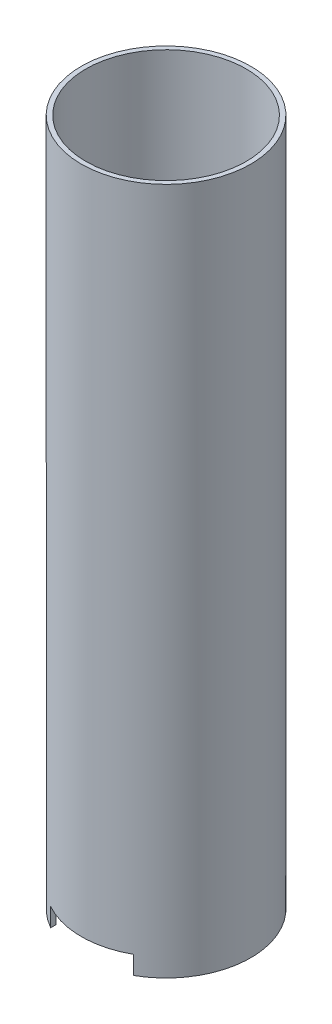
ISO-10303-21;
HEADER;
FILE_DESCRIPTION(('STEP AP214'),'2;1');
FILE_NAME('part.step','',(''),(''),'','','');
FILE_SCHEMA(('AUTOMOTIVE_DESIGN { 1 0 10303 214 1 1 1 1 }'));
ENDSEC;
DATA;
#1=APPLICATION_CONTEXT('core data for automotive mechanical design processes');
#2=APPLICATION_PROTOCOL_DEFINITION('international standard','automotive_design',2000,#1);
#3=PRODUCT_CONTEXT('',#1,'mechanical');
#4=PRODUCT('Part','Part','',(#3));
#5=PRODUCT_RELATED_PRODUCT_CATEGORY('part','',(#4));
#6=PRODUCT_DEFINITION_FORMATION('','',#4);
#7=PRODUCT_DEFINITION_CONTEXT('part definition',#1,'design');
#8=PRODUCT_DEFINITION('design','',#6,#7);
#9=PRODUCT_DEFINITION_SHAPE('','',#8);
#10=(LENGTH_UNIT() NAMED_UNIT(*) SI_UNIT(.MILLI.,.METRE.));
#11=(NAMED_UNIT(*) PLANE_ANGLE_UNIT() SI_UNIT($,.RADIAN.));
#12=(NAMED_UNIT(*) SI_UNIT($,.STERADIAN.) SOLID_ANGLE_UNIT());
#13=UNCERTAINTY_MEASURE_WITH_UNIT(LENGTH_MEASURE(1.E-05),#10,'distance_accuracy_value','');
#14=(GEOMETRIC_REPRESENTATION_CONTEXT(3) GLOBAL_UNCERTAINTY_ASSIGNED_CONTEXT((#13)) GLOBAL_UNIT_ASSIGNED_CONTEXT((#10,
#11,#12)) REPRESENTATION_CONTEXT('',''));
#15=CARTESIAN_POINT('',(0.,0.,0.));
#16=DIRECTION('',(0.,0.,1.));
#17=DIRECTION('',(1.,0.,0.));
#18=AXIS2_PLACEMENT_3D('',#15,#16,#17);
#19=CARTESIAN_POINT('',(0.,150.,0.));
#20=DIRECTION('',(0.,-1.,0.));
#21=DIRECTION('',(0.,0.,-1.));
#22=AXIS2_PLACEMENT_3D('',#19,#20,#21);
#23=CYLINDRICAL_SURFACE('',#22,17.5);
#24=CARTESIAN_POINT('',(0.,119.,0.));
#25=DIRECTION('',(0.,1.,0.));
#26=DIRECTION('',(0.,0.,1.));
#27=AXIS2_PLACEMENT_3D('',#24,#25,#26);
#28=CIRCLE('',#27,17.5);
#29=CARTESIAN_POINT('',(0.,119.,17.5));
#30=VERTEX_POINT('',#29);
#31=EDGE_CURVE('E206',#30,#30,#28,.T.);
#32=ORIENTED_EDGE('',*,*,#31,.T.);
#33=EDGE_LOOP('',(#32));
#34=FACE_BOUND('',#33,.T.);
#35=CARTESIAN_POINT('',(0.,4.,0.));
#36=DIRECTION('',(0.,1.,0.));
#37=DIRECTION('',(0.,0.,1.));
#38=AXIS2_PLACEMENT_3D('',#35,#36,#37);
#39=CIRCLE('',#38,17.5);
#40=CARTESIAN_POINT('',(9.01387818865997,4.,-15.));
#41=VERTEX_POINT('',#40);
#42=CARTESIAN_POINT('',(-9.01387818865997,4.,-15.));
#43=VERTEX_POINT('',#42);
#44=EDGE_CURVE('E132',#41,#43,#39,.T.);
#45=ORIENTED_EDGE('',*,*,#44,.F.);
#46=DIRECTION('',(0.,-1.,0.));
#47=VECTOR('',#46,1.);
#48=CARTESIAN_POINT('',(9.01387818865997,4.,-15.));
#49=LINE('',#48,#47);
#50=CARTESIAN_POINT('',(9.01387818865997,0.,-15.));
#51=VERTEX_POINT('',#50);
#52=EDGE_CURVE('E114',#41,#51,#49,.T.);
#53=ORIENTED_EDGE('',*,*,#52,.T.);
#54=CARTESIAN_POINT('',(0.,0.,0.));
#55=DIRECTION('',(0.,1.,0.));
#56=DIRECTION('',(0.,0.,1.));
#57=AXIS2_PLACEMENT_3D('',#54,#55,#56);
#58=CIRCLE('',#57,17.5);
#59=CARTESIAN_POINT('',(9.01387818865997,0.,15.));
#60=VERTEX_POINT('',#59);
#61=EDGE_CURVE('E218',#60,#51,#58,.T.);
#62=ORIENTED_EDGE('',*,*,#61,.F.);
#63=DIRECTION('',(0.,-1.,0.));
#64=VECTOR('',#63,1.);
#65=CARTESIAN_POINT('',(9.01387818865997,4.,15.));
#66=LINE('',#65,#64);
#67=CARTESIAN_POINT('',(9.01387818865997,4.,15.));
#68=VERTEX_POINT('',#67);
#69=EDGE_CURVE('E71',#68,#60,#66,.T.);
#70=ORIENTED_EDGE('',*,*,#69,.F.);
#71=CARTESIAN_POINT('',(0.,4.,0.));
#72=DIRECTION('',(0.,1.,0.));
#73=DIRECTION('',(0.,0.,1.));
#74=AXIS2_PLACEMENT_3D('',#71,#72,#73);
#75=CIRCLE('',#74,17.5);
#76=CARTESIAN_POINT('',(-9.01387818865997,4.,15.));
#77=VERTEX_POINT('',#76);
#78=EDGE_CURVE('E161',#77,#68,#75,.T.);
#79=ORIENTED_EDGE('',*,*,#78,.F.);
#80=DIRECTION('',(0.,-1.,0.));
#81=VECTOR('',#80,1.);
#82=CARTESIAN_POINT('',(-9.01387818865997,4.,15.));
#83=LINE('',#82,#81);
#84=CARTESIAN_POINT('',(-9.01387818865997,0.,15.));
#85=VERTEX_POINT('',#84);
#86=EDGE_CURVE('E151',#77,#85,#83,.T.);
#87=ORIENTED_EDGE('',*,*,#86,.T.);
#88=CARTESIAN_POINT('',(-9.01387818865997,0.,-15.));
#89=VERTEX_POINT('',#88);
#90=EDGE_CURVE('E225',#89,#85,#58,.T.);
#91=ORIENTED_EDGE('',*,*,#90,.F.);
#92=DIRECTION('',(0.,-1.,0.));
#93=VECTOR('',#92,1.);
#94=CARTESIAN_POINT('',(-9.01387818865997,4.,-15.));
#95=LINE('',#94,#93);
#96=EDGE_CURVE('E63',#43,#89,#95,.T.);
#97=ORIENTED_EDGE('',*,*,#96,.F.);
#98=EDGE_LOOP('',(#45,#53,#62,#70,#79,#87,#91,#97));
#99=FACE_BOUND('',#98,.T.);
#100=ADVANCED_FACE('F47',(#34,#99),#23,.F.);
#101=CARTESIAN_POINT('',(0.,150.,0.));
#102=DIRECTION('',(0.,-1.,0.));
#103=DIRECTION('',(0.,0.,-1.));
#104=AXIS2_PLACEMENT_3D('',#101,#102,#103);
#105=CYLINDRICAL_SURFACE('',#104,18.5);
#106=CARTESIAN_POINT('',(0.,150.,0.));
#107=DIRECTION('',(0.,1.,0.));
#108=DIRECTION('',(0.,0.,1.));
#109=AXIS2_PLACEMENT_3D('',#106,#107,#108);
#110=CIRCLE('',#109,18.5);
#111=CARTESIAN_POINT('',(0.,150.,18.5));
#112=VERTEX_POINT('',#111);
#113=EDGE_CURVE('E214',#112,#112,#110,.T.);
#114=ORIENTED_EDGE('',*,*,#113,.F.);
#115=EDGE_LOOP('',(#114));
#116=FACE_BOUND('',#115,.T.);
#117=DIRECTION('',(0.,-1.,0.));
#118=VECTOR('',#117,1.);
#119=CARTESIAN_POINT('',(9.01387818865997,4.,-16.1554944214035));
#120=LINE('',#119,#118);
#121=CARTESIAN_POINT('',(9.01387818865997,4.,-16.1554944214035));
#122=VERTEX_POINT('',#121);
#123=CARTESIAN_POINT('',(9.01387818865997,0.,-16.1554944214035));
#124=VERTEX_POINT('',#123);
#125=EDGE_CURVE('E127',#122,#124,#120,.T.);
#126=ORIENTED_EDGE('',*,*,#125,.F.);
#127=CARTESIAN_POINT('',(0.,4.,0.));
#128=DIRECTION('',(0.,1.,0.));
#129=DIRECTION('',(0.,0.,1.));
#130=AXIS2_PLACEMENT_3D('',#127,#128,#129);
#131=CIRCLE('',#130,18.5);
#132=CARTESIAN_POINT('',(-9.01387818865997,4.,-16.1554944214035));
#133=VERTEX_POINT('',#132);
#134=EDGE_CURVE('E134',#122,#133,#131,.T.);
#135=ORIENTED_EDGE('',*,*,#134,.T.);
#136=DIRECTION('',(0.,-1.,0.));
#137=VECTOR('',#136,1.);
#138=CARTESIAN_POINT('',(-9.01387818865997,4.,-16.1554944214035));
#139=LINE('',#138,#137);
#140=CARTESIAN_POINT('',(-9.01387818865997,0.,-16.1554944214035));
#141=VERTEX_POINT('',#140);
#142=EDGE_CURVE('E155',#133,#141,#139,.T.);
#143=ORIENTED_EDGE('',*,*,#142,.T.);
#144=CARTESIAN_POINT('',(0.,0.,0.));
#145=DIRECTION('',(0.,1.,0.));
#146=DIRECTION('',(0.,0.,1.));
#147=AXIS2_PLACEMENT_3D('',#144,#145,#146);
#148=CIRCLE('',#147,18.5);
#149=CARTESIAN_POINT('',(-9.01387818865997,0.,16.1554944214035));
#150=VERTEX_POINT('',#149);
#151=EDGE_CURVE('E213',#141,#150,#148,.T.);
#152=ORIENTED_EDGE('',*,*,#151,.T.);
#153=DIRECTION('',(0.,-1.,0.));
#154=VECTOR('',#153,1.);
#155=CARTESIAN_POINT('',(-9.01387818865997,4.,16.1554944214035));
#156=LINE('',#155,#154);
#157=CARTESIAN_POINT('',(-9.01387818865997,4.,16.1554944214035));
#158=VERTEX_POINT('',#157);
#159=EDGE_CURVE('E188',#158,#150,#156,.T.);
#160=ORIENTED_EDGE('',*,*,#159,.F.);
#161=CARTESIAN_POINT('',(0.,4.,0.));
#162=DIRECTION('',(0.,1.,0.));
#163=DIRECTION('',(0.,0.,1.));
#164=AXIS2_PLACEMENT_3D('',#161,#162,#163);
#165=CIRCLE('',#164,18.5);
#166=CARTESIAN_POINT('',(9.01387818865997,4.,16.1554944214035));
#167=VERTEX_POINT('',#166);
#168=EDGE_CURVE('E168',#158,#167,#165,.T.);
#169=ORIENTED_EDGE('',*,*,#168,.T.);
#170=DIRECTION('',(0.,-1.,0.));
#171=VECTOR('',#170,1.);
#172=CARTESIAN_POINT('',(9.01387818865997,4.,16.1554944214035));
#173=LINE('',#172,#171);
#174=CARTESIAN_POINT('',(9.01387818865997,0.,16.1554944214035));
#175=VERTEX_POINT('',#174);
#176=EDGE_CURVE('E184',#167,#175,#173,.T.);
#177=ORIENTED_EDGE('',*,*,#176,.T.);
#178=EDGE_CURVE('E222',#175,#124,#148,.T.);
#179=ORIENTED_EDGE('',*,*,#178,.T.);
#180=EDGE_LOOP('',(#126,#135,#143,#152,#160,#169,#177,#179));
#181=FACE_BOUND('',#180,.T.);
#182=ADVANCED_FACE('F49',(#116,#181),#105,.T.);
#183=CARTESIAN_POINT('',(0.,0.,0.));
#184=DIRECTION('',(0.,1.,0.));
#185=DIRECTION('',(0.,0.,1.));
#186=AXIS2_PLACEMENT_3D('',#183,#184,#185);
#187=PLANE('',#186);
#188=DIRECTION('',(0.,0.,-1.));
#189=VECTOR('',#188,1.);
#190=CARTESIAN_POINT('',(9.01387818865997,0.,0.));
#191=LINE('',#190,#189);
#192=EDGE_CURVE('E120',#51,#124,#191,.T.);
#193=ORIENTED_EDGE('',*,*,#192,.T.);
#194=ORIENTED_EDGE('',*,*,#178,.F.);
#195=DIRECTION('',(0.,0.,1.));
#196=VECTOR('',#195,1.);
#197=CARTESIAN_POINT('',(9.01387818865997,0.,0.));
#198=LINE('',#197,#196);
#199=EDGE_CURVE('E165',#60,#175,#198,.T.);
#200=ORIENTED_EDGE('',*,*,#199,.F.);
#201=ORIENTED_EDGE('',*,*,#61,.T.);
#202=EDGE_LOOP('',(#193,#194,#200,#201));
#203=FACE_BOUND('',#202,.T.);
#204=ADVANCED_FACE('F260',(#203),#187,.F.);
#205=ORIENTED_EDGE('',*,*,#151,.F.);
#206=DIRECTION('',(0.,0.,-1.));
#207=VECTOR('',#206,1.);
#208=CARTESIAN_POINT('',(-9.01387818865997,0.,0.));
#209=LINE('',#208,#207);
#210=EDGE_CURVE('E140',#89,#141,#209,.T.);
#211=ORIENTED_EDGE('',*,*,#210,.F.);
#212=ORIENTED_EDGE('',*,*,#90,.T.);
#213=DIRECTION('',(0.,0.,1.));
#214=VECTOR('',#213,1.);
#215=CARTESIAN_POINT('',(-9.01387818865997,0.,0.));
#216=LINE('',#215,#214);
#217=EDGE_CURVE('E176',#85,#150,#216,.T.);
#218=ORIENTED_EDGE('',*,*,#217,.T.);
#219=EDGE_LOOP('',(#205,#211,#212,#218));
#220=FACE_BOUND('',#219,.T.);
#221=ADVANCED_FACE('F232',(#220),#187,.F.);
#222=CARTESIAN_POINT('',(0.,121.,0.));
#223=DIRECTION('',(0.,1.,0.));
#224=DIRECTION('',(0.,0.,1.));
#225=AXIS2_PLACEMENT_3D('',#222,#223,#224);
#226=CIRCLE('',#225,17.5);
#227=CARTESIAN_POINT('',(0.,121.,17.5));
#228=VERTEX_POINT('',#227);
#229=EDGE_CURVE('E11',#228,#228,#226,.T.);
#230=ORIENTED_EDGE('',*,*,#229,.F.);
#231=EDGE_LOOP('',(#230));
#232=FACE_BOUND('',#231,.T.);
#233=CARTESIAN_POINT('',(0.,150.,0.));
#234=DIRECTION('',(0.,1.,0.));
#235=DIRECTION('',(0.,0.,1.));
#236=AXIS2_PLACEMENT_3D('',#233,#234,#235);
#237=CIRCLE('',#236,17.5);
#238=CARTESIAN_POINT('',(0.,150.,17.5));
#239=VERTEX_POINT('',#238);
#240=EDGE_CURVE('E56',#239,#239,#237,.T.);
#241=ORIENTED_EDGE('',*,*,#240,.T.);
#242=EDGE_LOOP('',(#241));
#243=FACE_BOUND('',#242,.T.);
#244=ADVANCED_FACE('F255',(#232,#243),#23,.F.);
#245=CARTESIAN_POINT('',(0.,150.,0.));
#246=DIRECTION('',(0.,1.,0.));
#247=DIRECTION('',(0.,0.,1.));
#248=AXIS2_PLACEMENT_3D('',#245,#246,#247);
#249=PLANE('',#248);
#250=ORIENTED_EDGE('',*,*,#113,.T.);
#251=EDGE_LOOP('',(#250));
#252=FACE_BOUND('',#251,.T.);
#253=ORIENTED_EDGE('',*,*,#240,.F.);
#254=EDGE_LOOP('',(#253));
#255=FACE_BOUND('',#254,.T.);
#256=ADVANCED_FACE('F264',(#252,#255),#249,.T.);
#257=CARTESIAN_POINT('',(0.,121.,0.));
#258=DIRECTION('',(0.,1.,0.));
#259=DIRECTION('',(0.,0.,1.));
#260=AXIS2_PLACEMENT_3D('',#257,#258,#259);
#261=PLANE('',#260);
#262=CARTESIAN_POINT('',(0.,121.,0.));
#263=DIRECTION('',(0.,1.,0.));
#264=DIRECTION('',(0.,0.,1.));
#265=AXIS2_PLACEMENT_3D('',#262,#263,#264);
#266=CIRCLE('',#265,6.5);
#267=CARTESIAN_POINT('',(0.,121.,6.5));
#268=VERTEX_POINT('',#267);
#269=EDGE_CURVE('E202',#268,#268,#266,.T.);
#270=ORIENTED_EDGE('',*,*,#269,.F.);
#271=EDGE_LOOP('',(#270));
#272=FACE_BOUND('',#271,.T.);
#273=ORIENTED_EDGE('',*,*,#229,.T.);
#274=EDGE_LOOP('',(#273));
#275=FACE_BOUND('',#274,.T.);
#276=CARTESIAN_POINT('',(0.,121.,12.));
#277=DIRECTION('',(0.,1.,0.));
#278=DIRECTION('',(0.,0.,1.));
#279=AXIS2_PLACEMENT_3D('',#276,#277,#278);
#280=CIRCLE('',#279,3.5);
#281=CARTESIAN_POINT('',(0.,121.,15.5));
#282=VERTEX_POINT('',#281);
#283=EDGE_CURVE('E194',#282,#282,#280,.T.);
#284=ORIENTED_EDGE('',*,*,#283,.F.);
#285=EDGE_LOOP('',(#284));
#286=FACE_BOUND('',#285,.T.);
#287=ADVANCED_FACE('F270',(#272,#275,#286),#261,.T.);
#288=CARTESIAN_POINT('',(0.,119.,0.));
#289=DIRECTION('',(0.,1.,0.));
#290=DIRECTION('',(0.,0.,1.));
#291=AXIS2_PLACEMENT_3D('',#288,#289,#290);
#292=PLANE('',#291);
#293=ORIENTED_EDGE('',*,*,#31,.F.);
#294=EDGE_LOOP('',(#293));
#295=FACE_BOUND('',#294,.T.);
#296=CARTESIAN_POINT('',(0.,119.,0.));
#297=DIRECTION('',(0.,1.,0.));
#298=DIRECTION('',(0.,0.,1.));
#299=AXIS2_PLACEMENT_3D('',#296,#297,#298);
#300=CIRCLE('',#299,6.5);
#301=CARTESIAN_POINT('',(0.,119.,6.5));
#302=VERTEX_POINT('',#301);
#303=EDGE_CURVE('E198',#302,#302,#300,.T.);
#304=ORIENTED_EDGE('',*,*,#303,.T.);
#305=EDGE_LOOP('',(#304));
#306=FACE_BOUND('',#305,.T.);
#307=CARTESIAN_POINT('',(0.,119.,12.));
#308=DIRECTION('',(0.,1.,0.));
#309=DIRECTION('',(0.,0.,1.));
#310=AXIS2_PLACEMENT_3D('',#307,#308,#309);
#311=CIRCLE('',#310,3.5);
#312=CARTESIAN_POINT('',(0.,119.,15.5));
#313=VERTEX_POINT('',#312);
#314=EDGE_CURVE('E126',#313,#313,#311,.T.);
#315=ORIENTED_EDGE('',*,*,#314,.T.);
#316=EDGE_LOOP('',(#315));
#317=FACE_BOUND('',#316,.T.);
#318=ADVANCED_FACE('F280',(#295,#306,#317),#292,.F.);
#319=CARTESIAN_POINT('',(0.,121.,0.));
#320=DIRECTION('',(0.,-1.,0.));
#321=DIRECTION('',(0.,0.,-1.));
#322=AXIS2_PLACEMENT_3D('',#319,#320,#321);
#323=CYLINDRICAL_SURFACE('',#322,6.5);
#324=ORIENTED_EDGE('',*,*,#269,.T.);
#325=EDGE_LOOP('',(#324));
#326=FACE_BOUND('',#325,.T.);
#327=ORIENTED_EDGE('',*,*,#303,.F.);
#328=EDGE_LOOP('',(#327));
#329=FACE_BOUND('',#328,.T.);
#330=ADVANCED_FACE('F287',(#326,#329),#323,.F.);
#331=CARTESIAN_POINT('',(0.,121.,12.));
#332=DIRECTION('',(0.,-1.,0.));
#333=DIRECTION('',(0.,0.,-1.));
#334=AXIS2_PLACEMENT_3D('',#331,#332,#333);
#335=CYLINDRICAL_SURFACE('',#334,3.5);
#336=ORIENTED_EDGE('',*,*,#283,.T.);
#337=EDGE_LOOP('',(#336));
#338=FACE_BOUND('',#337,.T.);
#339=ORIENTED_EDGE('',*,*,#314,.F.);
#340=EDGE_LOOP('',(#339));
#341=FACE_BOUND('',#340,.T.);
#342=ADVANCED_FACE('F285',(#338,#341),#335,.F.);
#343=CARTESIAN_POINT('',(-9.01387818865997,4.,0.));
#344=DIRECTION('',(1.,0.,0.));
#345=DIRECTION('',(0.,0.,-1.));
#346=AXIS2_PLACEMENT_3D('',#343,#344,#345);
#347=PLANE('',#346);
#348=ORIENTED_EDGE('',*,*,#217,.F.);
#349=ORIENTED_EDGE('',*,*,#86,.F.);
#350=DIRECTION('',(0.,0.,1.));
#351=VECTOR('',#350,1.);
#352=CARTESIAN_POINT('',(-9.01387818865997,4.,0.));
#353=LINE('',#352,#351);
#354=EDGE_CURVE('E164',#77,#158,#353,.T.);
#355=ORIENTED_EDGE('',*,*,#354,.T.);
#356=ORIENTED_EDGE('',*,*,#159,.T.);
#357=EDGE_LOOP('',(#348,#349,#355,#356));
#358=FACE_BOUND('',#357,.T.);
#359=ADVANCED_FACE('F237',(#358),#347,.T.);
#360=CARTESIAN_POINT('',(9.01387818865997,4.,0.));
#361=DIRECTION('',(1.,0.,0.));
#362=DIRECTION('',(0.,0.,-1.));
#363=AXIS2_PLACEMENT_3D('',#360,#361,#362);
#364=PLANE('',#363);
#365=ORIENTED_EDGE('',*,*,#199,.T.);
#366=ORIENTED_EDGE('',*,*,#176,.F.);
#367=DIRECTION('',(0.,0.,1.));
#368=VECTOR('',#367,1.);
#369=CARTESIAN_POINT('',(9.01387818865997,4.,0.));
#370=LINE('',#369,#368);
#371=EDGE_CURVE('E172',#68,#167,#370,.T.);
#372=ORIENTED_EDGE('',*,*,#371,.F.);
#373=ORIENTED_EDGE('',*,*,#69,.T.);
#374=EDGE_LOOP('',(#365,#366,#372,#373));
#375=FACE_BOUND('',#374,.T.);
#376=ADVANCED_FACE('F305',(#375),#364,.F.);
#377=CARTESIAN_POINT('',(0.,4.,0.));
#378=DIRECTION('',(0.,1.,0.));
#379=DIRECTION('',(0.,0.,1.));
#380=AXIS2_PLACEMENT_3D('',#377,#378,#379);
#381=PLANE('',#380);
#382=ORIENTED_EDGE('',*,*,#78,.T.);
#383=ORIENTED_EDGE('',*,*,#371,.T.);
#384=ORIENTED_EDGE('',*,*,#168,.F.);
#385=ORIENTED_EDGE('',*,*,#354,.F.);
#386=EDGE_LOOP('',(#382,#383,#384,#385));
#387=FACE_BOUND('',#386,.T.);
#388=ADVANCED_FACE('F240',(#387),#381,.F.);
#389=CARTESIAN_POINT('',(9.01387818865997,4.,0.));
#390=DIRECTION('',(-1.,0.,0.));
#391=DIRECTION('',(0.,0.,1.));
#392=AXIS2_PLACEMENT_3D('',#389,#390,#391);
#393=PLANE('',#392);
#394=ORIENTED_EDGE('',*,*,#192,.F.);
#395=ORIENTED_EDGE('',*,*,#52,.F.);
#396=DIRECTION('',(0.,0.,-1.));
#397=VECTOR('',#396,1.);
#398=CARTESIAN_POINT('',(9.01387818865997,4.,0.));
#399=LINE('',#398,#397);
#400=EDGE_CURVE('E117',#41,#122,#399,.T.);
#401=ORIENTED_EDGE('',*,*,#400,.T.);
#402=ORIENTED_EDGE('',*,*,#125,.T.);
#403=EDGE_LOOP('',(#394,#395,#401,#402));
#404=FACE_BOUND('',#403,.T.);
#405=ADVANCED_FACE('F116',(#404),#393,.T.);
#406=CARTESIAN_POINT('',(-9.01387818865997,4.,0.));
#407=DIRECTION('',(-1.,0.,0.));
#408=DIRECTION('',(0.,0.,1.));
#409=AXIS2_PLACEMENT_3D('',#406,#407,#408);
#410=PLANE('',#409);
#411=ORIENTED_EDGE('',*,*,#210,.T.);
#412=ORIENTED_EDGE('',*,*,#142,.F.);
#413=DIRECTION('',(0.,0.,-1.));
#414=VECTOR('',#413,1.);
#415=CARTESIAN_POINT('',(-9.01387818865997,4.,0.));
#416=LINE('',#415,#414);
#417=EDGE_CURVE('E147',#43,#133,#416,.T.);
#418=ORIENTED_EDGE('',*,*,#417,.F.);
#419=ORIENTED_EDGE('',*,*,#96,.T.);
#420=EDGE_LOOP('',(#411,#412,#418,#419));
#421=FACE_BOUND('',#420,.T.);
#422=ADVANCED_FACE('F244',(#421),#410,.F.);
#423=CARTESIAN_POINT('',(0.,4.,0.));
#424=DIRECTION('',(0.,1.,0.));
#425=DIRECTION('',(0.,0.,1.));
#426=AXIS2_PLACEMENT_3D('',#423,#424,#425);
#427=PLANE('',#426);
#428=ORIENTED_EDGE('',*,*,#44,.T.);
#429=ORIENTED_EDGE('',*,*,#417,.T.);
#430=ORIENTED_EDGE('',*,*,#134,.F.);
#431=ORIENTED_EDGE('',*,*,#400,.F.);
#432=EDGE_LOOP('',(#428,#429,#430,#431));
#433=FACE_BOUND('',#432,.T.);
#434=ADVANCED_FACE('F130',(#433),#427,.F.);
#435=CLOSED_SHELL('',(#100,#182,#204,#221,#244,#256,#287,#318,#330,#342,#359,#376,#388,#405,
#422,#434));
#436=MANIFOLD_SOLID_BREP('B2',#435);
#437=ADVANCED_BREP_SHAPE_REPRESENTATION('',(#18,#436),#14);
#438=SHAPE_DEFINITION_REPRESENTATION(#9,#437);
ENDSEC;
END-ISO-10303-21;
